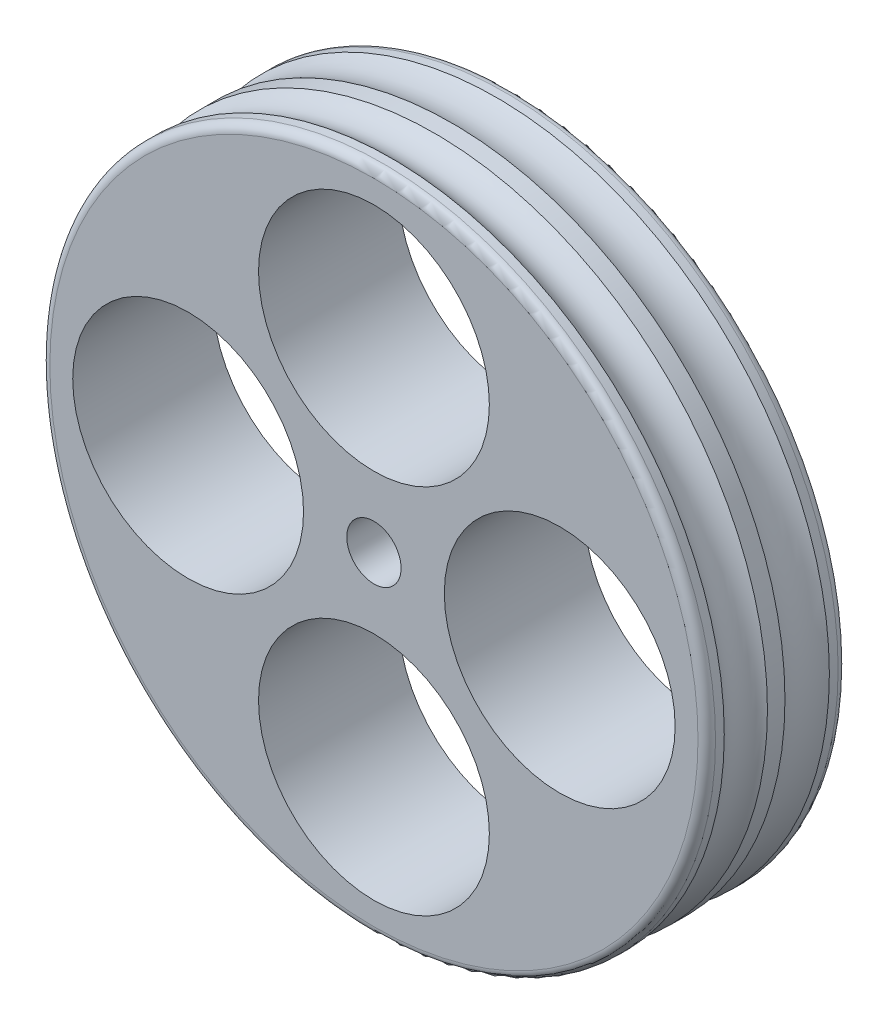
ISO-10303-21;
HEADER;
FILE_DESCRIPTION(('STEP AP214'),'2;1');
FILE_NAME('part.step','',(''),(''),'','','');
FILE_SCHEMA(('AUTOMOTIVE_DESIGN { 1 0 10303 214 1 1 1 1 }'));
ENDSEC;
DATA;
#1=APPLICATION_CONTEXT('core data for automotive mechanical design processes');
#2=APPLICATION_PROTOCOL_DEFINITION('international standard','automotive_design',2000,#1);
#3=PRODUCT_CONTEXT('',#1,'mechanical');
#4=PRODUCT('Part','Part','',(#3));
#5=PRODUCT_RELATED_PRODUCT_CATEGORY('part','',(#4));
#6=PRODUCT_DEFINITION_FORMATION('','',#4);
#7=PRODUCT_DEFINITION_CONTEXT('part definition',#1,'design');
#8=PRODUCT_DEFINITION('design','',#6,#7);
#9=PRODUCT_DEFINITION_SHAPE('','',#8);
#10=(LENGTH_UNIT() NAMED_UNIT(*) SI_UNIT(.MILLI.,.METRE.));
#11=(NAMED_UNIT(*) PLANE_ANGLE_UNIT() SI_UNIT($,.RADIAN.));
#12=(NAMED_UNIT(*) SI_UNIT($,.STERADIAN.) SOLID_ANGLE_UNIT());
#13=UNCERTAINTY_MEASURE_WITH_UNIT(LENGTH_MEASURE(1.E-05),#10,'distance_accuracy_value','');
#14=(GEOMETRIC_REPRESENTATION_CONTEXT(3) GLOBAL_UNCERTAINTY_ASSIGNED_CONTEXT((#13)) GLOBAL_UNIT_ASSIGNED_CONTEXT((#10,
#11,#12)) REPRESENTATION_CONTEXT('',''));
#15=CARTESIAN_POINT('',(0.,0.,0.));
#16=DIRECTION('',(0.,0.,1.));
#17=DIRECTION('',(1.,0.,0.));
#18=AXIS2_PLACEMENT_3D('',#15,#16,#17);
#19=CARTESIAN_POINT('',(0.,0.,8.));
#20=DIRECTION('',(0.,0.,-1.));
#21=DIRECTION('',(-1.,0.,0.));
#22=AXIS2_PLACEMENT_3D('',#19,#20,#21);
#23=CYLINDRICAL_SURFACE('',#22,19.);
#24=CARTESIAN_POINT('',(0.,0.,0.5));
#25=DIRECTION('',(0.,0.,1.));
#26=DIRECTION('',(1.,0.,0.));
#27=AXIS2_PLACEMENT_3D('',#24,#25,#26);
#28=CIRCLE('',#27,19.);
#29=CARTESIAN_POINT('',(19.,0.,0.5));
#30=VERTEX_POINT('',#29);
#31=EDGE_CURVE('E55',#30,#30,#28,.T.);
#32=ORIENTED_EDGE('',*,*,#31,.T.);
#33=EDGE_LOOP('',(#32));
#34=FACE_BOUND('',#33,.T.);
#35=CARTESIAN_POINT('',(0.,0.,1.));
#36=DIRECTION('',(0.,0.,1.));
#37=DIRECTION('',(1.,0.,0.));
#38=AXIS2_PLACEMENT_3D('',#35,#36,#37);
#39=CIRCLE('',#38,19.);
#40=CARTESIAN_POINT('',(19.,0.,1.));
#41=VERTEX_POINT('',#40);
#42=EDGE_CURVE('E66',#41,#41,#39,.T.);
#43=ORIENTED_EDGE('',*,*,#42,.F.);
#44=EDGE_LOOP('',(#43));
#45=FACE_BOUND('',#44,.T.);
#46=ADVANCED_FACE('F37',(#34,#45),#23,.T.);
#47=CARTESIAN_POINT('',(0.,0.,0.));
#48=DIRECTION('',(0.,0.,1.));
#49=DIRECTION('',(1.,0.,0.));
#50=AXIS2_PLACEMENT_3D('',#47,#48,#49);
#51=PLANE('',#50);
#52=CARTESIAN_POINT('',(0.,-10.6064601101063,0.));
#53=DIRECTION('',(0.,0.,1.));
#54=DIRECTION('',(-1.,0.,0.));
#55=AXIS2_PLACEMENT_3D('',#52,#53,#54);
#56=CIRCLE('',#55,6.58897104008716);
#57=CARTESIAN_POINT('',(-6.58897104008716,-10.6064601101063,0.));
#58=VERTEX_POINT('',#57);
#59=EDGE_CURVE('E98',#58,#58,#56,.T.);
#60=ORIENTED_EDGE('',*,*,#59,.T.);
#61=EDGE_LOOP('',(#60));
#62=FACE_BOUND('',#61,.T.);
#63=CARTESIAN_POINT('',(-10.6064601101063,1.1109677263686E-13,0.));
#64=DIRECTION('',(0.,0.,1.));
#65=DIRECTION('',(0.,1.,0.));
#66=AXIS2_PLACEMENT_3D('',#63,#64,#65);
#67=CIRCLE('',#66,6.58897104008716);
#68=CARTESIAN_POINT('',(-10.6064601101062,6.58897104008728,0.));
#69=VERTEX_POINT('',#68);
#70=EDGE_CURVE('E106',#69,#69,#67,.T.);
#71=ORIENTED_EDGE('',*,*,#70,.T.);
#72=EDGE_LOOP('',(#71));
#73=FACE_BOUND('',#72,.T.);
#74=CARTESIAN_POINT('',(10.6064601101063,0.,0.));
#75=DIRECTION('',(0.,0.,1.));
#76=DIRECTION('',(0.,-1.,0.));
#77=AXIS2_PLACEMENT_3D('',#74,#75,#76);
#78=CIRCLE('',#77,6.58897104008716);
#79=CARTESIAN_POINT('',(10.6064601101062,-6.5889710400872,0.));
#80=VERTEX_POINT('',#79);
#81=EDGE_CURVE('E90',#80,#80,#78,.T.);
#82=ORIENTED_EDGE('',*,*,#81,.T.);
#83=EDGE_LOOP('',(#82));
#84=FACE_BOUND('',#83,.T.);
#85=CARTESIAN_POINT('',(0.,10.6064601101063,0.));
#86=DIRECTION('',(0.,0.,1.));
#87=DIRECTION('',(1.,0.,0.));
#88=AXIS2_PLACEMENT_3D('',#85,#86,#87);
#89=CIRCLE('',#88,6.58897104008716);
#90=CARTESIAN_POINT('',(6.58897104008716,10.6064601101063,0.));
#91=VERTEX_POINT('',#90);
#92=EDGE_CURVE('E82',#91,#91,#89,.T.);
#93=ORIENTED_EDGE('',*,*,#92,.T.);
#94=EDGE_LOOP('',(#93));
#95=FACE_BOUND('',#94,.T.);
#96=CARTESIAN_POINT('',(0.,0.,0.));
#97=DIRECTION('',(0.,0.,1.));
#98=DIRECTION('',(1.,0.,0.));
#99=AXIS2_PLACEMENT_3D('',#96,#97,#98);
#100=CIRCLE('',#99,1.55);
#101=CARTESIAN_POINT('',(1.55,0.,0.));
#102=VERTEX_POINT('',#101);
#103=EDGE_CURVE('E71',#102,#102,#100,.T.);
#104=ORIENTED_EDGE('',*,*,#103,.T.);
#105=EDGE_LOOP('',(#104));
#106=FACE_BOUND('',#105,.T.);
#107=CARTESIAN_POINT('',(0.,0.,0.));
#108=DIRECTION('',(0.,0.,1.));
#109=DIRECTION('',(1.,0.,0.));
#110=AXIS2_PLACEMENT_3D('',#107,#108,#109);
#111=CIRCLE('',#110,18.5);
#112=CARTESIAN_POINT('',(18.5,0.,0.));
#113=VERTEX_POINT('',#112);
#114=EDGE_CURVE('E50',#113,#113,#111,.F.);
#115=ORIENTED_EDGE('',*,*,#114,.T.);
#116=EDGE_LOOP('',(#115));
#117=FACE_BOUND('',#116,.T.);
#118=ADVANCED_FACE('F118',(#62,#73,#84,#95,#106,#117),#51,.F.);
#119=CARTESIAN_POINT('',(0.,0.,2.26760034544782));
#120=DIRECTION('',(0.,0.,1.));
#121=DIRECTION('',(1.,0.,0.));
#122=AXIS2_PLACEMENT_3D('',#119,#120,#121);
#123=TOROIDAL_SURFACE('',#122,21.528017726299,2.82801772629903);
#124=ORIENTED_EDGE('',*,*,#42,.T.);
#125=EDGE_LOOP('',(#124));
#126=FACE_BOUND('',#125,.T.);
#127=CARTESIAN_POINT('',(0.,0.,3.53520069089564));
#128=DIRECTION('',(0.,0.,1.));
#129=DIRECTION('',(1.,0.,0.));
#130=AXIS2_PLACEMENT_3D('',#127,#128,#129);
#131=CIRCLE('',#130,19.);
#132=CARTESIAN_POINT('',(19.,0.,3.53520069089564));
#133=VERTEX_POINT('',#132);
#134=EDGE_CURVE('E61',#133,#133,#131,.T.);
#135=ORIENTED_EDGE('',*,*,#134,.F.);
#136=EDGE_LOOP('',(#135));
#137=FACE_BOUND('',#136,.T.);
#138=ADVANCED_FACE('F164',(#126,#137),#123,.F.);
#139=CARTESIAN_POINT('',(0.,0.,4.53520069089564));
#140=DIRECTION('',(0.,0.,1.));
#141=DIRECTION('',(1.,0.,0.));
#142=AXIS2_PLACEMENT_3D('',#139,#140,#141);
#143=CIRCLE('',#142,19.);
#144=CARTESIAN_POINT('',(19.,0.,4.53520069089564));
#145=VERTEX_POINT('',#144);
#146=EDGE_CURVE('E67',#145,#145,#143,.T.);
#147=ORIENTED_EDGE('',*,*,#146,.F.);
#148=EDGE_LOOP('',(#147));
#149=FACE_BOUND('',#148,.T.);
#150=ORIENTED_EDGE('',*,*,#134,.T.);
#151=EDGE_LOOP('',(#150));
#152=FACE_BOUND('',#151,.T.);
#153=ADVANCED_FACE('F160',(#149,#152),#23,.T.);
#154=CARTESIAN_POINT('',(0.,0.,5.76760034544782));
#155=DIRECTION('',(0.,0.,1.));
#156=DIRECTION('',(1.,0.,0.));
#157=AXIS2_PLACEMENT_3D('',#154,#155,#156);
#158=TOROIDAL_SURFACE('',#157,20.2688089085403,1.76880890854034);
#159=ORIENTED_EDGE('',*,*,#146,.T.);
#160=EDGE_LOOP('',(#159));
#161=FACE_BOUND('',#160,.T.);
#162=CARTESIAN_POINT('',(0.,0.,7.));
#163=DIRECTION('',(0.,0.,1.));
#164=DIRECTION('',(1.,0.,0.));
#165=AXIS2_PLACEMENT_3D('',#162,#163,#164);
#166=CIRCLE('',#165,19.);
#167=CARTESIAN_POINT('',(19.,0.,7.));
#168=VERTEX_POINT('',#167);
#169=EDGE_CURVE('E62',#168,#168,#166,.T.);
#170=ORIENTED_EDGE('',*,*,#169,.F.);
#171=EDGE_LOOP('',(#170));
#172=FACE_BOUND('',#171,.T.);
#173=ADVANCED_FACE('F133',(#161,#172),#158,.F.);
#174=CARTESIAN_POINT('',(0.,0.,8.));
#175=DIRECTION('',(0.,0.,1.));
#176=DIRECTION('',(1.,0.,0.));
#177=AXIS2_PLACEMENT_3D('',#174,#175,#176);
#178=PLANE('',#177);
#179=CARTESIAN_POINT('',(0.,-10.6064601101063,8.));
#180=DIRECTION('',(0.,0.,1.));
#181=DIRECTION('',(-1.,0.,0.));
#182=AXIS2_PLACEMENT_3D('',#179,#180,#181);
#183=CIRCLE('',#182,6.58897104008716);
#184=CARTESIAN_POINT('',(-6.58897104008716,-10.6064601101063,8.));
#185=VERTEX_POINT('',#184);
#186=EDGE_CURVE('E102',#185,#185,#183,.T.);
#187=ORIENTED_EDGE('',*,*,#186,.F.);
#188=EDGE_LOOP('',(#187));
#189=FACE_BOUND('',#188,.T.);
#190=CARTESIAN_POINT('',(-10.6064601101063,1.1109677263686E-13,8.));
#191=DIRECTION('',(0.,0.,1.));
#192=DIRECTION('',(0.,1.,0.));
#193=AXIS2_PLACEMENT_3D('',#190,#191,#192);
#194=CIRCLE('',#193,6.58897104008716);
#195=CARTESIAN_POINT('',(-10.6064601101062,6.58897104008728,8.));
#196=VERTEX_POINT('',#195);
#197=EDGE_CURVE('E110',#196,#196,#194,.T.);
#198=ORIENTED_EDGE('',*,*,#197,.F.);
#199=EDGE_LOOP('',(#198));
#200=FACE_BOUND('',#199,.T.);
#201=CARTESIAN_POINT('',(10.6064601101063,0.,8.));
#202=DIRECTION('',(0.,0.,1.));
#203=DIRECTION('',(0.,-1.,0.));
#204=AXIS2_PLACEMENT_3D('',#201,#202,#203);
#205=CIRCLE('',#204,6.58897104008716);
#206=CARTESIAN_POINT('',(10.6064601101062,-6.5889710400872,8.));
#207=VERTEX_POINT('',#206);
#208=EDGE_CURVE('E94',#207,#207,#205,.T.);
#209=ORIENTED_EDGE('',*,*,#208,.F.);
#210=EDGE_LOOP('',(#209));
#211=FACE_BOUND('',#210,.T.);
#212=CARTESIAN_POINT('',(0.,10.6064601101063,8.));
#213=DIRECTION('',(0.,0.,1.));
#214=DIRECTION('',(1.,0.,0.));
#215=AXIS2_PLACEMENT_3D('',#212,#213,#214);
#216=CIRCLE('',#215,6.58897104008716);
#217=CARTESIAN_POINT('',(6.58897104008716,10.6064601101063,8.));
#218=VERTEX_POINT('',#217);
#219=EDGE_CURVE('E86',#218,#218,#216,.T.);
#220=ORIENTED_EDGE('',*,*,#219,.F.);
#221=EDGE_LOOP('',(#220));
#222=FACE_BOUND('',#221,.T.);
#223=CARTESIAN_POINT('',(0.,0.,8.));
#224=DIRECTION('',(0.,0.,1.));
#225=DIRECTION('',(1.,0.,0.));
#226=AXIS2_PLACEMENT_3D('',#223,#224,#225);
#227=CIRCLE('',#226,1.55);
#228=CARTESIAN_POINT('',(1.55,0.,8.));
#229=VERTEX_POINT('',#228);
#230=EDGE_CURVE('E78',#229,#229,#227,.T.);
#231=ORIENTED_EDGE('',*,*,#230,.F.);
#232=EDGE_LOOP('',(#231));
#233=FACE_BOUND('',#232,.T.);
#234=CARTESIAN_POINT('',(0.,0.,8.));
#235=DIRECTION('',(0.,0.,1.));
#236=DIRECTION('',(1.,0.,0.));
#237=AXIS2_PLACEMENT_3D('',#234,#235,#236);
#238=CIRCLE('',#237,18.5);
#239=CARTESIAN_POINT('',(18.5,0.,8.));
#240=VERTEX_POINT('',#239);
#241=EDGE_CURVE('E45',#240,#240,#238,.T.);
#242=ORIENTED_EDGE('',*,*,#241,.T.);
#243=EDGE_LOOP('',(#242));
#244=FACE_BOUND('',#243,.T.);
#245=ADVANCED_FACE('F129',(#189,#200,#211,#222,#233,#244),#178,.T.);
#246=CARTESIAN_POINT('',(0.,0.,7.5));
#247=DIRECTION('',(0.,0.,1.));
#248=DIRECTION('',(1.,0.,0.));
#249=AXIS2_PLACEMENT_3D('',#246,#247,#248);
#250=CIRCLE('',#249,19.);
#251=CARTESIAN_POINT('',(19.,0.,7.5));
#252=VERTEX_POINT('',#251);
#253=EDGE_CURVE('E10',#252,#252,#250,.F.);
#254=ORIENTED_EDGE('',*,*,#253,.T.);
#255=EDGE_LOOP('',(#254));
#256=FACE_BOUND('',#255,.T.);
#257=ORIENTED_EDGE('',*,*,#169,.T.);
#258=EDGE_LOOP('',(#257));
#259=FACE_BOUND('',#258,.T.);
#260=ADVANCED_FACE('F132',(#256,#259),#23,.T.);
#261=CARTESIAN_POINT('',(0.,0.,0.5));
#262=DIRECTION('',(0.,0.,1.));
#263=DIRECTION('',(1.,0.,0.));
#264=AXIS2_PLACEMENT_3D('',#261,#262,#263);
#265=TOROIDAL_SURFACE('',#264,18.5,0.5);
#266=ORIENTED_EDGE('',*,*,#114,.F.);
#267=EDGE_LOOP('',(#266));
#268=FACE_BOUND('',#267,.T.);
#269=ORIENTED_EDGE('',*,*,#31,.F.);
#270=EDGE_LOOP('',(#269));
#271=FACE_BOUND('',#270,.T.);
#272=ADVANCED_FACE('F153',(#268,#271),#265,.T.);
#273=CARTESIAN_POINT('',(0.,0.,7.5));
#274=DIRECTION('',(0.,0.,1.));
#275=DIRECTION('',(1.,0.,0.));
#276=AXIS2_PLACEMENT_3D('',#273,#274,#275);
#277=TOROIDAL_SURFACE('',#276,18.5,0.5);
#278=ORIENTED_EDGE('',*,*,#253,.F.);
#279=EDGE_LOOP('',(#278));
#280=FACE_BOUND('',#279,.T.);
#281=ORIENTED_EDGE('',*,*,#241,.F.);
#282=EDGE_LOOP('',(#281));
#283=FACE_BOUND('',#282,.T.);
#284=ADVANCED_FACE('F39',(#280,#283),#277,.T.);
#285=CARTESIAN_POINT('',(0.,0.,0.));
#286=DIRECTION('',(0.,0.,1.));
#287=DIRECTION('',(1.,0.,0.));
#288=AXIS2_PLACEMENT_3D('',#285,#286,#287);
#289=CYLINDRICAL_SURFACE('',#288,1.55);
#290=ORIENTED_EDGE('',*,*,#103,.F.);
#291=EDGE_LOOP('',(#290));
#292=FACE_BOUND('',#291,.T.);
#293=ORIENTED_EDGE('',*,*,#230,.T.);
#294=EDGE_LOOP('',(#293));
#295=FACE_BOUND('',#294,.T.);
#296=ADVANCED_FACE('F142',(#292,#295),#289,.F.);
#297=CARTESIAN_POINT('',(0.,10.6064601101063,0.));
#298=DIRECTION('',(0.,0.,1.));
#299=DIRECTION('',(1.,0.,0.));
#300=AXIS2_PLACEMENT_3D('',#297,#298,#299);
#301=CYLINDRICAL_SURFACE('',#300,6.58897104008716);
#302=ORIENTED_EDGE('',*,*,#92,.F.);
#303=EDGE_LOOP('',(#302));
#304=FACE_BOUND('',#303,.T.);
#305=ORIENTED_EDGE('',*,*,#219,.T.);
#306=EDGE_LOOP('',(#305));
#307=FACE_BOUND('',#306,.T.);
#308=ADVANCED_FACE('F144',(#304,#307),#301,.F.);
#309=CARTESIAN_POINT('',(10.6064601101063,0.,0.));
#310=DIRECTION('',(0.,0.,1.));
#311=DIRECTION('',(1.,0.,0.));
#312=AXIS2_PLACEMENT_3D('',#309,#310,#311);
#313=CYLINDRICAL_SURFACE('',#312,6.58897104008716);
#314=ORIENTED_EDGE('',*,*,#81,.F.);
#315=EDGE_LOOP('',(#314));
#316=FACE_BOUND('',#315,.T.);
#317=ORIENTED_EDGE('',*,*,#208,.T.);
#318=EDGE_LOOP('',(#317));
#319=FACE_BOUND('',#318,.T.);
#320=ADVANCED_FACE('F125',(#316,#319),#313,.F.);
#321=CARTESIAN_POINT('',(-10.6064601101063,1.1109677263686E-13,0.));
#322=DIRECTION('',(0.,0.,1.));
#323=DIRECTION('',(1.,0.,0.));
#324=AXIS2_PLACEMENT_3D('',#321,#322,#323);
#325=CYLINDRICAL_SURFACE('',#324,6.58897104008716);
#326=ORIENTED_EDGE('',*,*,#70,.F.);
#327=EDGE_LOOP('',(#326));
#328=FACE_BOUND('',#327,.T.);
#329=ORIENTED_EDGE('',*,*,#197,.T.);
#330=EDGE_LOOP('',(#329));
#331=FACE_BOUND('',#330,.T.);
#332=ADVANCED_FACE('F121',(#328,#331),#325,.F.);
#333=CARTESIAN_POINT('',(0.,-10.6064601101063,0.));
#334=DIRECTION('',(0.,0.,1.));
#335=DIRECTION('',(1.,0.,0.));
#336=AXIS2_PLACEMENT_3D('',#333,#334,#335);
#337=CYLINDRICAL_SURFACE('',#336,6.58897104008716);
#338=ORIENTED_EDGE('',*,*,#59,.F.);
#339=EDGE_LOOP('',(#338));
#340=FACE_BOUND('',#339,.T.);
#341=ORIENTED_EDGE('',*,*,#186,.T.);
#342=EDGE_LOOP('',(#341));
#343=FACE_BOUND('',#342,.T.);
#344=ADVANCED_FACE('F124',(#340,#343),#337,.F.);
#345=CLOSED_SHELL('',(#46,#118,#138,#153,#173,#245,#260,#272,#284,#296,#308,#320,#332,#344));
#346=MANIFOLD_SOLID_BREP('B2',#345);
#347=ADVANCED_BREP_SHAPE_REPRESENTATION('',(#18,#346),#14);
#348=SHAPE_DEFINITION_REPRESENTATION(#9,#347);
ENDSEC;
END-ISO-10303-21;
